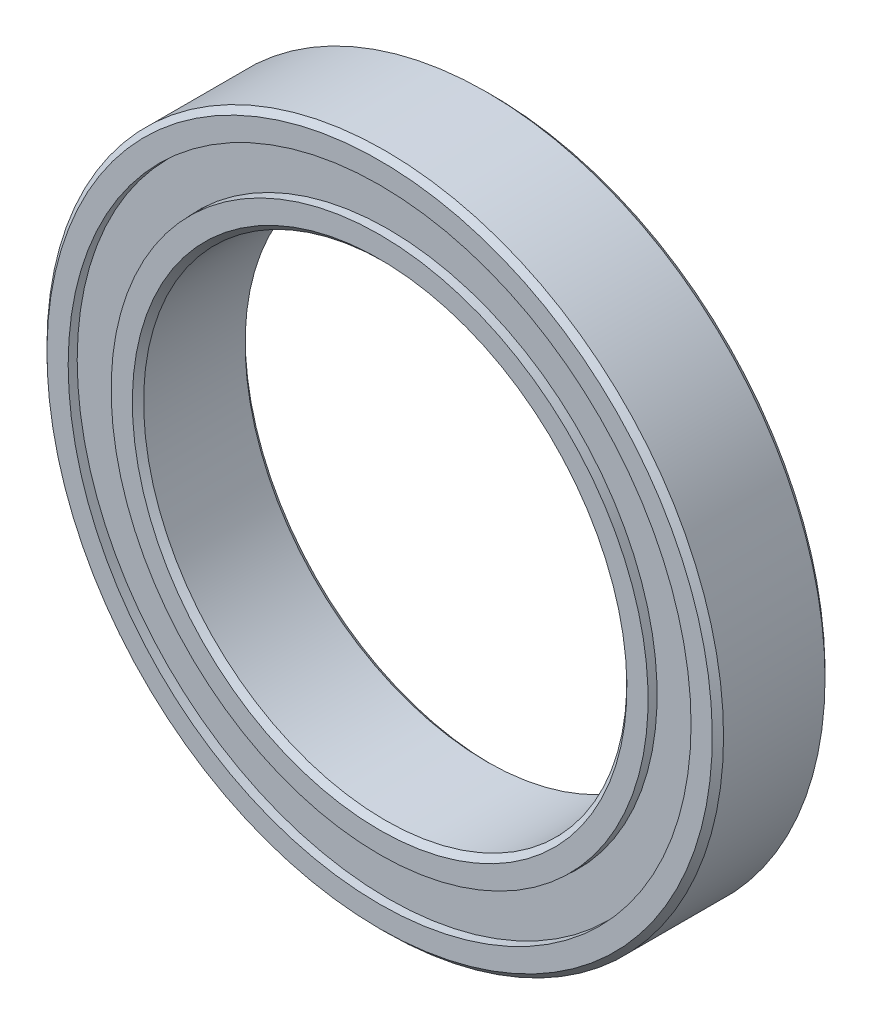
ISO-10303-21;
HEADER;
FILE_DESCRIPTION(('STEP AP214'),'2;1');
FILE_NAME('part.step','',(''),(''),'','','');
FILE_SCHEMA(('AUTOMOTIVE_DESIGN { 1 0 10303 214 1 1 1 1 }'));
ENDSEC;
DATA;
#1=APPLICATION_CONTEXT('core data for automotive mechanical design processes');
#2=APPLICATION_PROTOCOL_DEFINITION('international standard','automotive_design',2000,#1);
#3=PRODUCT_CONTEXT('',#1,'mechanical');
#4=PRODUCT('Part','Part','',(#3));
#5=PRODUCT_RELATED_PRODUCT_CATEGORY('part','',(#4));
#6=PRODUCT_DEFINITION_FORMATION('','',#4);
#7=PRODUCT_DEFINITION_CONTEXT('part definition',#1,'design');
#8=PRODUCT_DEFINITION('design','',#6,#7);
#9=PRODUCT_DEFINITION_SHAPE('','',#8);
#10=(LENGTH_UNIT() NAMED_UNIT(*) SI_UNIT(.MILLI.,.METRE.));
#11=(NAMED_UNIT(*) PLANE_ANGLE_UNIT() SI_UNIT($,.RADIAN.));
#12=(NAMED_UNIT(*) SI_UNIT($,.STERADIAN.) SOLID_ANGLE_UNIT());
#13=UNCERTAINTY_MEASURE_WITH_UNIT(LENGTH_MEASURE(1.E-05),#10,'distance_accuracy_value','');
#14=(GEOMETRIC_REPRESENTATION_CONTEXT(3) GLOBAL_UNCERTAINTY_ASSIGNED_CONTEXT((#13)) GLOBAL_UNIT_ASSIGNED_CONTEXT((#10,
#11,#12)) REPRESENTATION_CONTEXT('',''));
#15=CARTESIAN_POINT('',(0.,0.,0.));
#16=DIRECTION('',(0.,0.,1.));
#17=DIRECTION('',(1.,0.,0.));
#18=AXIS2_PLACEMENT_3D('',#15,#16,#17);
#19=CARTESIAN_POINT('',(6.50234999136853,16.7845001292785,0.));
#20=DIRECTION('',(0.,0.,1.));
#21=DIRECTION('',(0.361241666187141,0.932472229404361,0.));
#22=AXIS2_PLACEMENT_3D('',#19,#20,#21);
#23=SPHERICAL_SURFACE('',#22,2.0487876571762);
#24=CARTESIAN_POINT('',(6.50234999136853,16.7845001292785,2.04878765717619));
#25=VERTEX_POINT('',#24);
#26=VERTEX_LOOP('',#25);
#27=FACE_BOUND('',#26,.T.);
#28=ADVANCED_FACE('F37',(#27),#23,.T.);
#29=CLOSED_SHELL('',(#28));
#30=MANIFOLD_SOLID_BREP('B2',#29);
#31=CARTESIAN_POINT('',(12.1265215856379,13.302160509972,0.));
#32=DIRECTION('',(0.,0.,1.));
#33=DIRECTION('',(0.673695643646548,0.739008917220668,0.));
#34=AXIS2_PLACEMENT_3D('',#31,#32,#33);
#35=SPHERICAL_SURFACE('',#34,2.0487876571762);
#36=CARTESIAN_POINT('',(12.1265215856379,13.302160509972,2.04878765717619));
#37=VERTEX_POINT('',#36);
#38=VERTEX_LOOP('',#37);
#39=FACE_BOUND('',#38,.T.);
#40=ADVANCED_FACE('F57',(#39),#35,.T.);
#41=CLOSED_SHELL('',(#40));
#42=MANIFOLD_SOLID_BREP('B6',#41);
#43=CARTESIAN_POINT('',(16.112939244391,8.02329040397788,0.));
#44=DIRECTION('',(0.,0.,1.));
#45=DIRECTION('',(0.895163291355057,0.445738355776549,0.));
#46=AXIS2_PLACEMENT_3D('',#43,#44,#45);
#47=SPHERICAL_SURFACE('',#46,2.0487876571762);
#48=CARTESIAN_POINT('',(16.112939244391,8.02329040397788,2.04878765717619));
#49=VERTEX_POINT('',#48);
#50=VERTEX_LOOP('',#49);
#51=FACE_BOUND('',#50,.T.);
#52=ADVANCED_FACE('F77',(#51),#47,.T.);
#53=CLOSED_SHELL('',(#52));
#54=MANIFOLD_SOLID_BREP('B33',#53);
#55=CARTESIAN_POINT('',(17.9232151733106,1.66083047033963,0.));
#56=DIRECTION('',(0.,0.,1.));
#57=DIRECTION('',(0.995734176295033,0.092268359463313,0.));
#58=AXIS2_PLACEMENT_3D('',#55,#56,#57);
#59=SPHERICAL_SURFACE('',#58,2.0487876571762);
#60=CARTESIAN_POINT('',(17.9232151733106,1.66083047033963,2.04878765717619));
#61=VERTEX_POINT('',#60);
#62=VERTEX_LOOP('',#61);
#63=FACE_BOUND('',#62,.T.);
#64=ADVANCED_FACE('F97',(#63),#59,.T.);
#65=CLOSED_SHELL('',(#64));
#66=MANIFOLD_SOLID_BREP('B53',#65);
#67=CARTESIAN_POINT('',(17.3128615771108,-4.92593382129731,0.));
#68=DIRECTION('',(0.,0.,1.));
#69=DIRECTION('',(0.961825643172822,-0.273662990072073,0.));
#70=AXIS2_PLACEMENT_3D('',#67,#68,#69);
#71=SPHERICAL_SURFACE('',#70,2.0487876571762);
#72=CARTESIAN_POINT('',(17.3128615771108,-4.92593382129731,2.04878765717619));
#73=VERTEX_POINT('',#72);
#74=VERTEX_LOOP('',#73);
#75=FACE_BOUND('',#74,.T.);
#76=ADVANCED_FACE('F117',(#75),#71,.T.);
#77=CLOSED_SHELL('',(#76));
#78=MANIFOLD_SOLID_BREP('B73',#77);
#79=CARTESIAN_POINT('',(14.3643100910444,-10.8474234548265,0.));
#80=DIRECTION('',(0.,0.,1.));
#81=DIRECTION('',(0.798017227280245,-0.602634636379249,0.));
#82=AXIS2_PLACEMENT_3D('',#79,#80,#81);
#83=SPHERICAL_SURFACE('',#82,2.0487876571762);
#84=CARTESIAN_POINT('',(14.3643100910444,-10.8474234548265,2.04878765717619));
#85=VERTEX_POINT('',#84);
#86=VERTEX_LOOP('',#85);
#87=FACE_BOUND('',#86,.T.);
#88=ADVANCED_FACE('F137',(#87),#83,.T.);
#89=CLOSED_SHELL('',(#88));
#90=MANIFOLD_SOLID_BREP('B93',#89);
#91=CARTESIAN_POINT('',(9.47577893179253,-15.303908443133,0.));
#92=DIRECTION('',(0.,0.,1.));
#93=DIRECTION('',(0.526432162877363,-0.85021713572961,0.));
#94=AXIS2_PLACEMENT_3D('',#91,#92,#93);
#95=SPHERICAL_SURFACE('',#94,2.0487876571762);
#96=CARTESIAN_POINT('',(9.47577893179253,-15.303908443133,2.04878765717619));
#97=VERTEX_POINT('',#96);
#98=VERTEX_LOOP('',#97);
#99=FACE_BOUND('',#98,.T.);
#100=ADVANCED_FACE('F157',(#99),#95,.T.);
#101=CLOSED_SHELL('',(#100));
#102=MANIFOLD_SOLID_BREP('B113',#101);
#103=CARTESIAN_POINT('',(3.3074913206984,-17.6935157943102,0.));
#104=DIRECTION('',(0.,0.,1.));
#105=DIRECTION('',(0.183749517816578,-0.9829730996839,0.));
#106=AXIS2_PLACEMENT_3D('',#103,#104,#105);
#107=SPHERICAL_SURFACE('',#106,2.0487876571762);
#108=CARTESIAN_POINT('',(3.3074913206984,-17.6935157943102,2.04878765717619));
#109=VERTEX_POINT('',#108);
#110=VERTEX_LOOP('',#109);
#111=FACE_BOUND('',#110,.T.);
#112=ADVANCED_FACE('F177',(#111),#107,.T.);
#113=CLOSED_SHELL('',(#112));
#114=MANIFOLD_SOLID_BREP('B133',#113);
#115=CARTESIAN_POINT('',(-3.30749132069815,-17.6935157943103,0.));
#116=DIRECTION('',(0.,0.,1.));
#117=DIRECTION('',(-0.183749517816564,-0.982973099683903,0.));
#118=AXIS2_PLACEMENT_3D('',#115,#116,#117);
#119=SPHERICAL_SURFACE('',#118,2.0487876571762);
#120=CARTESIAN_POINT('',(-3.30749132069815,-17.6935157943103,2.04878765717619));
#121=VERTEX_POINT('',#120);
#122=VERTEX_LOOP('',#121);
#123=FACE_BOUND('',#122,.T.);
#124=ADVANCED_FACE('F197',(#123),#119,.T.);
#125=CLOSED_SHELL('',(#124));
#126=MANIFOLD_SOLID_BREP('B153',#125);
#127=CARTESIAN_POINT('',(-9.47577893179231,-15.3039084431331,0.));
#128=DIRECTION('',(0.,0.,1.));
#129=DIRECTION('',(-0.526432162877351,-0.850217135729617,0.));
#130=AXIS2_PLACEMENT_3D('',#127,#128,#129);
#131=SPHERICAL_SURFACE('',#130,2.0487876571762);
#132=CARTESIAN_POINT('',(-9.47577893179231,-15.3039084431331,2.04878765717619));
#133=VERTEX_POINT('',#132);
#134=VERTEX_LOOP('',#133);
#135=FACE_BOUND('',#134,.T.);
#136=ADVANCED_FACE('F217',(#135),#131,.T.);
#137=CLOSED_SHELL('',(#136));
#138=MANIFOLD_SOLID_BREP('B173',#137);
#139=CARTESIAN_POINT('',(-14.3643100910443,-10.8474234548267,0.));
#140=DIRECTION('',(0.,0.,1.));
#141=DIRECTION('',(-0.798017227280236,-0.602634636379261,0.));
#142=AXIS2_PLACEMENT_3D('',#139,#140,#141);
#143=SPHERICAL_SURFACE('',#142,2.0487876571762);
#144=CARTESIAN_POINT('',(-14.3643100910443,-10.8474234548267,2.04878765717619));
#145=VERTEX_POINT('',#144);
#146=VERTEX_LOOP('',#145);
#147=FACE_BOUND('',#146,.T.);
#148=ADVANCED_FACE('F237',(#147),#143,.T.);
#149=CLOSED_SHELL('',(#148));
#150=MANIFOLD_SOLID_BREP('B193',#149);
#151=CARTESIAN_POINT('',(-17.3128615771107,-4.92593382129756,0.));
#152=DIRECTION('',(0.,0.,1.));
#153=DIRECTION('',(-0.961825643172818,-0.273662990072087,0.));
#154=AXIS2_PLACEMENT_3D('',#151,#152,#153);
#155=SPHERICAL_SURFACE('',#154,2.0487876571762);
#156=CARTESIAN_POINT('',(-17.3128615771107,-4.92593382129756,2.04878765717619));
#157=VERTEX_POINT('',#156);
#158=VERTEX_LOOP('',#157);
#159=FACE_BOUND('',#158,.T.);
#160=ADVANCED_FACE('F257',(#159),#155,.T.);
#161=CLOSED_SHELL('',(#160));
#162=MANIFOLD_SOLID_BREP('B213',#161);
#163=CARTESIAN_POINT('',(-17.9232151733106,1.66083047033938,0.));
#164=DIRECTION('',(0.,0.,1.));
#165=DIRECTION('',(-0.995734176295035,0.0922683594632987,0.));
#166=AXIS2_PLACEMENT_3D('',#163,#164,#165);
#167=SPHERICAL_SURFACE('',#166,2.0487876571762);
#168=CARTESIAN_POINT('',(-17.9232151733106,1.66083047033938,2.04878765717619));
#169=VERTEX_POINT('',#168);
#170=VERTEX_LOOP('',#169);
#171=FACE_BOUND('',#170,.T.);
#172=ADVANCED_FACE('F277',(#171),#167,.T.);
#173=CLOSED_SHELL('',(#172));
#174=MANIFOLD_SOLID_BREP('B233',#173);
#175=CARTESIAN_POINT('',(-16.1129392443911,8.02329040397765,0.));
#176=DIRECTION('',(0.,0.,1.));
#177=DIRECTION('',(-0.895163291355063,0.445738355776536,0.));
#178=AXIS2_PLACEMENT_3D('',#175,#176,#177);
#179=SPHERICAL_SURFACE('',#178,2.0487876571762);
#180=CARTESIAN_POINT('',(-16.1129392443911,8.02329040397765,2.04878765717619));
#181=VERTEX_POINT('',#180);
#182=VERTEX_LOOP('',#181);
#183=FACE_BOUND('',#182,.T.);
#184=ADVANCED_FACE('F297',(#183),#179,.T.);
#185=CLOSED_SHELL('',(#184));
#186=MANIFOLD_SOLID_BREP('B253',#185);
#187=CARTESIAN_POINT('',(-12.1265215856381,13.3021605099718,0.));
#188=DIRECTION('',(0.,0.,1.));
#189=DIRECTION('',(-0.673695643646558,0.739008917220658,0.));
#190=AXIS2_PLACEMENT_3D('',#187,#188,#189);
#191=SPHERICAL_SURFACE('',#190,2.0487876571762);
#192=CARTESIAN_POINT('',(-12.1265215856381,13.3021605099718,2.04878765717619));
#193=VERTEX_POINT('',#192);
#194=VERTEX_LOOP('',#193);
#195=FACE_BOUND('',#194,.T.);
#196=ADVANCED_FACE('F317',(#195),#191,.T.);
#197=CLOSED_SHELL('',(#196));
#198=MANIFOLD_SOLID_BREP('B273',#197);
#199=CARTESIAN_POINT('',(-6.50234999136877,16.7845001292784,0.));
#200=DIRECTION('',(0.,0.,1.));
#201=DIRECTION('',(-0.361241666187154,0.932472229404355,0.));
#202=AXIS2_PLACEMENT_3D('',#199,#200,#201);
#203=SPHERICAL_SURFACE('',#202,2.0487876571762);
#204=CARTESIAN_POINT('',(-6.50234999136877,16.7845001292784,2.04878765717619));
#205=VERTEX_POINT('',#204);
#206=VERTEX_LOOP('',#205);
#207=FACE_BOUND('',#206,.T.);
#208=ADVANCED_FACE('F337',(#207),#203,.T.);
#209=CLOSED_SHELL('',(#208));
#210=MANIFOLD_SOLID_BREP('B293',#209);
#211=CARTESIAN_POINT('',(0.,18.,0.));
#212=DIRECTION('',(0.,0.,1.));
#213=DIRECTION('',(0.,1.,0.));
#214=AXIS2_PLACEMENT_3D('',#211,#212,#213);
#215=SPHERICAL_SURFACE('',#214,2.0487876571762);
#216=CARTESIAN_POINT('',(0.,18.,2.04878765717619));
#217=VERTEX_POINT('',#216);
#218=VERTEX_LOOP('',#217);
#219=FACE_BOUND('',#218,.T.);
#220=ADVANCED_FACE('F359',(#219),#215,.T.);
#221=CLOSED_SHELL('',(#220));
#222=MANIFOLD_SOLID_BREP('B313',#221);
#223=CARTESIAN_POINT('',(0.,16.6666666666667,3.50000000000003));
#224=DIRECTION('',(0.,0.,-1.));
#225=DIRECTION('',(0.,1.,0.));
#226=AXIS2_PLACEMENT_3D('',#223,#224,#225);
#227=PLANE('',#226);
#228=CARTESIAN_POINT('',(0.,0.,3.50000000000002));
#229=DIRECTION('',(0.,0.,1.));
#230=DIRECTION('',(0.,-1.,0.));
#231=AXIS2_PLACEMENT_3D('',#228,#229,#230);
#232=CIRCLE('',#231,15.35);
#233=CARTESIAN_POINT('',(0.,-15.35,3.50000000000002));
#234=VERTEX_POINT('',#233);
#235=EDGE_CURVE('E407',#234,#234,#232,.T.);
#236=ORIENTED_EDGE('',*,*,#235,.F.);
#237=EDGE_LOOP('',(#236));
#238=FACE_BOUND('',#237,.T.);
#239=CARTESIAN_POINT('',(0.,0.,3.50000000000002));
#240=DIRECTION('',(0.,0.,1.));
#241=DIRECTION('',(0.,-1.,0.));
#242=AXIS2_PLACEMENT_3D('',#239,#240,#241);
#243=CIRCLE('',#242,16.6666666666667);
#244=CARTESIAN_POINT('',(0.,-16.6666666666667,3.50000000000002));
#245=VERTEX_POINT('',#244);
#246=EDGE_CURVE('E358',#245,#245,#243,.T.);
#247=ORIENTED_EDGE('',*,*,#246,.T.);
#248=EDGE_LOOP('',(#247));
#249=FACE_BOUND('',#248,.T.);
#250=ADVANCED_FACE('F379',(#238,#249),#227,.F.);
#251=CARTESIAN_POINT('',(0.,0.,3.50000000000002));
#252=DIRECTION('',(0.,0.,1.));
#253=DIRECTION('',(0.,-1.,0.));
#254=AXIS2_PLACEMENT_3D('',#251,#252,#253);
#255=CYLINDRICAL_SURFACE('',#254,16.6666666666667);
#256=ORIENTED_EDGE('',*,*,#246,.F.);
#257=EDGE_LOOP('',(#256));
#258=FACE_BOUND('',#257,.T.);
#259=CARTESIAN_POINT('',(0.,0.,1.55555555555555));
#260=DIRECTION('',(0.,0.,1.));
#261=DIRECTION('',(0.,-1.,0.));
#262=AXIS2_PLACEMENT_3D('',#259,#260,#261);
#263=CIRCLE('',#262,16.6666666666667);
#264=CARTESIAN_POINT('',(0.,-16.6666666666667,1.55555555555555));
#265=VERTEX_POINT('',#264);
#266=EDGE_CURVE('E385',#265,#265,#263,.T.);
#267=ORIENTED_EDGE('',*,*,#266,.T.);
#268=EDGE_LOOP('',(#267));
#269=FACE_BOUND('',#268,.T.);
#270=ADVANCED_FACE('F414',(#258,#269),#255,.T.);
#271=CARTESIAN_POINT('',(0.,0.,0.));
#272=DIRECTION('',(0.,0.,1.));
#273=DIRECTION('',(0.,-1.,0.));
#274=AXIS2_PLACEMENT_3D('',#271,#272,#273);
#275=TOROIDAL_SURFACE('',#274,18.,2.0487876571762);
#276=ORIENTED_EDGE('',*,*,#266,.F.);
#277=EDGE_LOOP('',(#276));
#278=FACE_BOUND('',#277,.T.);
#279=CARTESIAN_POINT('',(0.,0.,-1.55555555555555));
#280=DIRECTION('',(0.,0.,1.));
#281=DIRECTION('',(0.,-1.,0.));
#282=AXIS2_PLACEMENT_3D('',#279,#280,#281);
#283=CIRCLE('',#282,16.6666666666667);
#284=CARTESIAN_POINT('',(0.,-16.6666666666667,-1.55555555555556));
#285=VERTEX_POINT('',#284);
#286=EDGE_CURVE('E389',#285,#285,#283,.T.);
#287=ORIENTED_EDGE('',*,*,#286,.T.);
#288=EDGE_LOOP('',(#287));
#289=FACE_BOUND('',#288,.T.);
#290=ADVANCED_FACE('F418',(#278,#289),#275,.F.);
#291=CARTESIAN_POINT('',(0.,0.,3.50000000000002));
#292=DIRECTION('',(0.,0.,1.));
#293=DIRECTION('',(0.,-1.,0.));
#294=AXIS2_PLACEMENT_3D('',#291,#292,#293);
#295=CYLINDRICAL_SURFACE('',#294,16.6666666666667);
#296=ORIENTED_EDGE('',*,*,#286,.F.);
#297=EDGE_LOOP('',(#296));
#298=FACE_BOUND('',#297,.T.);
#299=CARTESIAN_POINT('',(0.,0.,-3.50000000000003));
#300=DIRECTION('',(0.,0.,1.));
#301=DIRECTION('',(0.,-1.,0.));
#302=AXIS2_PLACEMENT_3D('',#299,#300,#301);
#303=CIRCLE('',#302,16.6666666666667);
#304=CARTESIAN_POINT('',(0.,-16.6666666666667,-3.50000000000003));
#305=VERTEX_POINT('',#304);
#306=EDGE_CURVE('E393',#305,#305,#303,.T.);
#307=ORIENTED_EDGE('',*,*,#306,.T.);
#308=EDGE_LOOP('',(#307));
#309=FACE_BOUND('',#308,.T.);
#310=ADVANCED_FACE('F423',(#298,#309),#295,.T.);
#311=CARTESIAN_POINT('',(0.,15.35,-3.50000000000003));
#312=DIRECTION('',(0.,0.,1.));
#313=DIRECTION('',(0.,-1.,0.));
#314=AXIS2_PLACEMENT_3D('',#311,#312,#313);
#315=PLANE('',#314);
#316=ORIENTED_EDGE('',*,*,#306,.F.);
#317=EDGE_LOOP('',(#316));
#318=FACE_BOUND('',#317,.T.);
#319=CARTESIAN_POINT('',(0.,0.,-3.50000000000003));
#320=DIRECTION('',(0.,0.,1.));
#321=DIRECTION('',(0.,-1.,0.));
#322=AXIS2_PLACEMENT_3D('',#319,#320,#321);
#323=CIRCLE('',#322,15.35);
#324=CARTESIAN_POINT('',(0.,-15.35,-3.50000000000003));
#325=VERTEX_POINT('',#324);
#326=EDGE_CURVE('E398',#325,#325,#323,.T.);
#327=ORIENTED_EDGE('',*,*,#326,.T.);
#328=EDGE_LOOP('',(#327));
#329=FACE_BOUND('',#328,.T.);
#330=ADVANCED_FACE('F429',(#318,#329),#315,.F.);
#331=CARTESIAN_POINT('',(0.,0.,-3.15000000000003));
#332=DIRECTION('',(0.,0.,-1.));
#333=DIRECTION('',(0.,1.,0.));
#334=AXIS2_PLACEMENT_3D('',#331,#332,#333);
#335=CONICAL_SURFACE('',#334,15.,0.785398163397435);
#336=ORIENTED_EDGE('',*,*,#326,.F.);
#337=EDGE_LOOP('',(#336));
#338=FACE_BOUND('',#337,.T.);
#339=CARTESIAN_POINT('',(0.,0.,-3.15000000000003));
#340=DIRECTION('',(0.,0.,1.));
#341=DIRECTION('',(0.,-1.,0.));
#342=AXIS2_PLACEMENT_3D('',#339,#340,#341);
#343=CIRCLE('',#342,15.);
#344=CARTESIAN_POINT('',(0.,-15.,-3.15000000000003));
#345=VERTEX_POINT('',#344);
#346=EDGE_CURVE('E401',#345,#345,#343,.T.);
#347=ORIENTED_EDGE('',*,*,#346,.T.);
#348=EDGE_LOOP('',(#347));
#349=FACE_BOUND('',#348,.T.);
#350=ADVANCED_FACE('F433',(#338,#349),#335,.F.);
#351=CARTESIAN_POINT('',(0.,0.,3.50000000000002));
#352=DIRECTION('',(0.,0.,1.));
#353=DIRECTION('',(0.,-1.,0.));
#354=AXIS2_PLACEMENT_3D('',#351,#352,#353);
#355=CYLINDRICAL_SURFACE('',#354,15.);
#356=ORIENTED_EDGE('',*,*,#346,.F.);
#357=EDGE_LOOP('',(#356));
#358=FACE_BOUND('',#357,.T.);
#359=CARTESIAN_POINT('',(0.,0.,3.15000000000003));
#360=DIRECTION('',(0.,0.,1.));
#361=DIRECTION('',(0.,-1.,0.));
#362=AXIS2_PLACEMENT_3D('',#359,#360,#361);
#363=CIRCLE('',#362,15.);
#364=CARTESIAN_POINT('',(0.,-15.,3.15000000000003));
#365=VERTEX_POINT('',#364);
#366=EDGE_CURVE('E404',#365,#365,#363,.T.);
#367=ORIENTED_EDGE('',*,*,#366,.T.);
#368=EDGE_LOOP('',(#367));
#369=FACE_BOUND('',#368,.T.);
#370=ADVANCED_FACE('F437',(#358,#369),#355,.F.);
#371=CARTESIAN_POINT('',(0.,0.,3.50000000000002));
#372=DIRECTION('',(0.,0.,1.));
#373=DIRECTION('',(0.,-1.,0.));
#374=AXIS2_PLACEMENT_3D('',#371,#372,#373);
#375=CONICAL_SURFACE('',#374,15.35,0.785398163397458);
#376=ORIENTED_EDGE('',*,*,#366,.F.);
#377=EDGE_LOOP('',(#376));
#378=FACE_BOUND('',#377,.T.);
#379=ORIENTED_EDGE('',*,*,#235,.T.);
#380=EDGE_LOOP('',(#379));
#381=FACE_BOUND('',#380,.T.);
#382=ADVANCED_FACE('F411',(#378,#381),#375,.F.);
#383=CLOSED_SHELL('',(#250,#270,#290,#310,#330,#350,#370,#382));
#384=MANIFOLD_SOLID_BREP('B333',#383);
#385=CARTESIAN_POINT('',(0.,16.6920666666667,-2.58389382858811));
#386=DIRECTION('',(0.,0.,-1.));
#387=DIRECTION('',(0.,1.,0.));
#388=AXIS2_PLACEMENT_3D('',#385,#386,#387);
#389=PLANE('',#388);
#390=CARTESIAN_POINT('',(0.,0.,-2.58389382858812));
#391=DIRECTION('',(0.,0.,1.));
#392=DIRECTION('',(0.,-1.,0.));
#393=AXIS2_PLACEMENT_3D('',#390,#391,#392);
#394=CIRCLE('',#393,16.6920666666667);
#395=CARTESIAN_POINT('',(0.,-16.6920666666667,-2.58389382858812));
#396=VERTEX_POINT('',#395);
#397=EDGE_CURVE('E522',#396,#396,#394,.T.);
#398=ORIENTED_EDGE('',*,*,#397,.F.);
#399=EDGE_LOOP('',(#398));
#400=FACE_BOUND('',#399,.T.);
#401=CARTESIAN_POINT('',(0.,0.,-2.58389382858812));
#402=DIRECTION('',(0.,0.,1.));
#403=DIRECTION('',(0.,-1.,0.));
#404=AXIS2_PLACEMENT_3D('',#401,#402,#403);
#405=CIRCLE('',#404,19.3079333333333);
#406=CARTESIAN_POINT('',(0.,-19.3079333333333,-2.58389382858812));
#407=VERTEX_POINT('',#406);
#408=EDGE_CURVE('E378',#407,#407,#405,.T.);
#409=ORIENTED_EDGE('',*,*,#408,.T.);
#410=EDGE_LOOP('',(#409));
#411=FACE_BOUND('',#410,.T.);
#412=ADVANCED_FACE('F508',(#400,#411),#389,.F.);
#413=CARTESIAN_POINT('',(0.,0.,3.50000000000002));
#414=DIRECTION('',(0.,0.,1.));
#415=DIRECTION('',(0.,-1.,0.));
#416=AXIS2_PLACEMENT_3D('',#413,#414,#415);
#417=CYLINDRICAL_SURFACE('',#416,19.3079333333333);
#418=ORIENTED_EDGE('',*,*,#408,.F.);
#419=EDGE_LOOP('',(#418));
#420=FACE_BOUND('',#419,.T.);
#421=CARTESIAN_POINT('',(0.,0.,-2.96489382858812));
#422=DIRECTION('',(0.,0.,1.));
#423=DIRECTION('',(0.,-1.,0.));
#424=AXIS2_PLACEMENT_3D('',#421,#422,#423);
#425=CIRCLE('',#424,19.3079333333333);
#426=CARTESIAN_POINT('',(0.,-19.3079333333333,-2.96489382858812));
#427=VERTEX_POINT('',#426);
#428=EDGE_CURVE('E514',#427,#427,#425,.T.);
#429=ORIENTED_EDGE('',*,*,#428,.T.);
#430=EDGE_LOOP('',(#429));
#431=FACE_BOUND('',#430,.T.);
#432=ADVANCED_FACE('F531',(#420,#431),#417,.T.);
#433=CARTESIAN_POINT('',(0.,16.6920666666667,-2.96489382858811));
#434=DIRECTION('',(0.,0.,1.));
#435=DIRECTION('',(0.,-1.,0.));
#436=AXIS2_PLACEMENT_3D('',#433,#434,#435);
#437=PLANE('',#436);
#438=ORIENTED_EDGE('',*,*,#428,.F.);
#439=EDGE_LOOP('',(#438));
#440=FACE_BOUND('',#439,.T.);
#441=CARTESIAN_POINT('',(0.,0.,-2.96489382858812));
#442=DIRECTION('',(0.,0.,1.));
#443=DIRECTION('',(0.,-1.,0.));
#444=AXIS2_PLACEMENT_3D('',#441,#442,#443);
#445=CIRCLE('',#444,16.6920666666667);
#446=CARTESIAN_POINT('',(0.,-16.6920666666667,-2.96489382858812));
#447=VERTEX_POINT('',#446);
#448=EDGE_CURVE('E518',#447,#447,#445,.T.);
#449=ORIENTED_EDGE('',*,*,#448,.T.);
#450=EDGE_LOOP('',(#449));
#451=FACE_BOUND('',#450,.T.);
#452=ADVANCED_FACE('F535',(#440,#451),#437,.F.);
#453=CARTESIAN_POINT('',(0.,0.,3.50000000000002));
#454=DIRECTION('',(0.,0.,1.));
#455=DIRECTION('',(0.,-1.,0.));
#456=AXIS2_PLACEMENT_3D('',#453,#454,#455);
#457=CYLINDRICAL_SURFACE('',#456,16.6920666666667);
#458=ORIENTED_EDGE('',*,*,#448,.F.);
#459=EDGE_LOOP('',(#458));
#460=FACE_BOUND('',#459,.T.);
#461=ORIENTED_EDGE('',*,*,#397,.T.);
#462=EDGE_LOOP('',(#461));
#463=FACE_BOUND('',#462,.T.);
#464=ADVANCED_FACE('F528',(#460,#463),#457,.F.);
#465=CLOSED_SHELL('',(#412,#432,#452,#464));
#466=MANIFOLD_SOLID_BREP('B353',#465);
#467=CARTESIAN_POINT('',(0.,16.6920666666667,2.9648938285881));
#468=DIRECTION('',(0.,0.,-1.));
#469=DIRECTION('',(0.,1.,0.));
#470=AXIS2_PLACEMENT_3D('',#467,#468,#469);
#471=PLANE('',#470);
#472=CARTESIAN_POINT('',(0.,0.,2.9648938285881));
#473=DIRECTION('',(0.,0.,1.));
#474=DIRECTION('',(0.,-1.,0.));
#475=AXIS2_PLACEMENT_3D('',#472,#473,#474);
#476=CIRCLE('',#475,16.6920666666667);
#477=CARTESIAN_POINT('',(0.,-16.6920666666667,2.9648938285881));
#478=VERTEX_POINT('',#477);
#479=EDGE_CURVE('E507',#478,#478,#476,.T.);
#480=ORIENTED_EDGE('',*,*,#479,.F.);
#481=EDGE_LOOP('',(#480));
#482=FACE_BOUND('',#481,.T.);
#483=CARTESIAN_POINT('',(0.,0.,2.9648938285881));
#484=DIRECTION('',(0.,0.,1.));
#485=DIRECTION('',(0.,-1.,0.));
#486=AXIS2_PLACEMENT_3D('',#483,#484,#485);
#487=CIRCLE('',#486,19.3079333333333);
#488=CARTESIAN_POINT('',(0.,-19.3079333333333,2.9648938285881));
#489=VERTEX_POINT('',#488);
#490=EDGE_CURVE('E590',#489,#489,#487,.T.);
#491=ORIENTED_EDGE('',*,*,#490,.T.);
#492=EDGE_LOOP('',(#491));
#493=FACE_BOUND('',#492,.T.);
#494=ADVANCED_FACE('F576',(#482,#493),#471,.F.);
#495=CARTESIAN_POINT('',(0.,0.,3.50000000000002));
#496=DIRECTION('',(0.,0.,1.));
#497=DIRECTION('',(0.,-1.,0.));
#498=AXIS2_PLACEMENT_3D('',#495,#496,#497);
#499=CYLINDRICAL_SURFACE('',#498,16.6920666666667);
#500=CARTESIAN_POINT('',(0.,0.,2.5838938285881));
#501=DIRECTION('',(0.,0.,1.));
#502=DIRECTION('',(0.,-1.,0.));
#503=AXIS2_PLACEMENT_3D('',#500,#501,#502);
#504=CIRCLE('',#503,16.6920666666667);
#505=CARTESIAN_POINT('',(0.,-16.6920666666667,2.5838938285881));
#506=VERTEX_POINT('',#505);
#507=EDGE_CURVE('E582',#506,#506,#504,.T.);
#508=ORIENTED_EDGE('',*,*,#507,.F.);
#509=EDGE_LOOP('',(#508));
#510=FACE_BOUND('',#509,.T.);
#511=ORIENTED_EDGE('',*,*,#479,.T.);
#512=EDGE_LOOP('',(#511));
#513=FACE_BOUND('',#512,.T.);
#514=ADVANCED_FACE('F605',(#510,#513),#499,.F.);
#515=CARTESIAN_POINT('',(0.,16.6920666666667,2.5838938285881));
#516=DIRECTION('',(0.,0.,1.));
#517=DIRECTION('',(0.,-1.,0.));
#518=AXIS2_PLACEMENT_3D('',#515,#516,#517);
#519=PLANE('',#518);
#520=CARTESIAN_POINT('',(0.,0.,2.5838938285881));
#521=DIRECTION('',(0.,0.,1.));
#522=DIRECTION('',(0.,-1.,0.));
#523=AXIS2_PLACEMENT_3D('',#520,#521,#522);
#524=CIRCLE('',#523,19.3079333333333);
#525=CARTESIAN_POINT('',(0.,-19.3079333333333,2.5838938285881));
#526=VERTEX_POINT('',#525);
#527=EDGE_CURVE('E586',#526,#526,#524,.T.);
#528=ORIENTED_EDGE('',*,*,#527,.F.);
#529=EDGE_LOOP('',(#528));
#530=FACE_BOUND('',#529,.T.);
#531=ORIENTED_EDGE('',*,*,#507,.T.);
#532=EDGE_LOOP('',(#531));
#533=FACE_BOUND('',#532,.T.);
#534=ADVANCED_FACE('F600',(#530,#533),#519,.F.);
#535=CARTESIAN_POINT('',(0.,0.,3.50000000000002));
#536=DIRECTION('',(0.,0.,1.));
#537=DIRECTION('',(0.,-1.,0.));
#538=AXIS2_PLACEMENT_3D('',#535,#536,#537);
#539=CYLINDRICAL_SURFACE('',#538,19.3079333333333);
#540=ORIENTED_EDGE('',*,*,#490,.F.);
#541=EDGE_LOOP('',(#540));
#542=FACE_BOUND('',#541,.T.);
#543=ORIENTED_EDGE('',*,*,#527,.T.);
#544=EDGE_LOOP('',(#543));
#545=FACE_BOUND('',#544,.T.);
#546=ADVANCED_FACE('F597',(#542,#545),#539,.T.);
#547=CLOSED_SHELL('',(#494,#514,#534,#546));
#548=MANIFOLD_SOLID_BREP('B373',#547);
#549=CARTESIAN_POINT('',(0.,0.,3.15000000000001));
#550=DIRECTION('',(0.,0.,-1.));
#551=DIRECTION('',(0.,1.,0.));
#552=AXIS2_PLACEMENT_3D('',#549,#550,#551);
#553=CONICAL_SURFACE('',#552,21.,0.785398163397447);
#554=CARTESIAN_POINT('',(0.,0.,3.50000000000001));
#555=DIRECTION('',(0.,0.,1.));
#556=DIRECTION('',(0.,-1.,0.));
#557=AXIS2_PLACEMENT_3D('',#554,#555,#556);
#558=CIRCLE('',#557,20.65);
#559=CARTESIAN_POINT('',(0.,-20.65,3.50000000000001));
#560=VERTEX_POINT('',#559);
#561=EDGE_CURVE('E665',#560,#560,#558,.T.);
#562=ORIENTED_EDGE('',*,*,#561,.F.);
#563=EDGE_LOOP('',(#562));
#564=FACE_BOUND('',#563,.T.);
#565=CARTESIAN_POINT('',(0.,0.,3.15000000000001));
#566=DIRECTION('',(0.,0.,1.));
#567=DIRECTION('',(0.,-1.,0.));
#568=AXIS2_PLACEMENT_3D('',#565,#566,#567);
#569=CIRCLE('',#568,21.);
#570=CARTESIAN_POINT('',(0.,-21.,3.15000000000001));
#571=VERTEX_POINT('',#570);
#572=EDGE_CURVE('E575',#571,#571,#569,.T.);
#573=ORIENTED_EDGE('',*,*,#572,.T.);
#574=EDGE_LOOP('',(#573));
#575=FACE_BOUND('',#574,.T.);
#576=ADVANCED_FACE('F637',(#564,#575),#553,.T.);
#577=CARTESIAN_POINT('',(0.,0.,3.50000000000002));
#578=DIRECTION('',(0.,0.,1.));
#579=DIRECTION('',(0.,-1.,0.));
#580=AXIS2_PLACEMENT_3D('',#577,#578,#579);
#581=CYLINDRICAL_SURFACE('',#580,21.);
#582=ORIENTED_EDGE('',*,*,#572,.F.);
#583=EDGE_LOOP('',(#582));
#584=FACE_BOUND('',#583,.T.);
#585=CARTESIAN_POINT('',(0.,0.,-3.15000000000003));
#586=DIRECTION('',(0.,0.,1.));
#587=DIRECTION('',(0.,-1.,0.));
#588=AXIS2_PLACEMENT_3D('',#585,#586,#587);
#589=CIRCLE('',#588,21.);
#590=CARTESIAN_POINT('',(0.,-21.,-3.15000000000003));
#591=VERTEX_POINT('',#590);
#592=EDGE_CURVE('E643',#591,#591,#589,.T.);
#593=ORIENTED_EDGE('',*,*,#592,.T.);
#594=EDGE_LOOP('',(#593));
#595=FACE_BOUND('',#594,.T.);
#596=ADVANCED_FACE('F672',(#584,#595),#581,.T.);
#597=CARTESIAN_POINT('',(0.,0.,-3.50000000000003));
#598=DIRECTION('',(0.,0.,1.));
#599=DIRECTION('',(0.,-1.,0.));
#600=AXIS2_PLACEMENT_3D('',#597,#598,#599);
#601=CONICAL_SURFACE('',#600,20.65,0.785398163397447);
#602=ORIENTED_EDGE('',*,*,#592,.F.);
#603=EDGE_LOOP('',(#602));
#604=FACE_BOUND('',#603,.T.);
#605=CARTESIAN_POINT('',(0.,0.,-3.50000000000003));
#606=DIRECTION('',(0.,0.,1.));
#607=DIRECTION('',(0.,-1.,0.));
#608=AXIS2_PLACEMENT_3D('',#605,#606,#607);
#609=CIRCLE('',#608,20.65);
#610=CARTESIAN_POINT('',(0.,-20.65,-3.50000000000003));
#611=VERTEX_POINT('',#610);
#612=EDGE_CURVE('E647',#611,#611,#609,.T.);
#613=ORIENTED_EDGE('',*,*,#612,.T.);
#614=EDGE_LOOP('',(#613));
#615=FACE_BOUND('',#614,.T.);
#616=ADVANCED_FACE('F676',(#604,#615),#601,.T.);
#617=CARTESIAN_POINT('',(0.,20.65,-3.50000000000002));
#618=DIRECTION('',(0.,0.,1.));
#619=DIRECTION('',(0.,-1.,0.));
#620=AXIS2_PLACEMENT_3D('',#617,#618,#619);
#621=PLANE('',#620);
#622=ORIENTED_EDGE('',*,*,#612,.F.);
#623=EDGE_LOOP('',(#622));
#624=FACE_BOUND('',#623,.T.);
#625=CARTESIAN_POINT('',(0.,0.,-3.50000000000002));
#626=DIRECTION('',(0.,0.,1.));
#627=DIRECTION('',(0.,-1.,0.));
#628=AXIS2_PLACEMENT_3D('',#625,#626,#627);
#629=CIRCLE('',#628,19.3333333333333);
#630=CARTESIAN_POINT('',(0.,-19.3333333333333,-3.50000000000003));
#631=VERTEX_POINT('',#630);
#632=EDGE_CURVE('E651',#631,#631,#629,.T.);
#633=ORIENTED_EDGE('',*,*,#632,.T.);
#634=EDGE_LOOP('',(#633));
#635=FACE_BOUND('',#634,.T.);
#636=ADVANCED_FACE('F681',(#624,#635),#621,.F.);
#637=CARTESIAN_POINT('',(0.,0.,3.50000000000002));
#638=DIRECTION('',(0.,0.,1.));
#639=DIRECTION('',(0.,-1.,0.));
#640=AXIS2_PLACEMENT_3D('',#637,#638,#639);
#641=CYLINDRICAL_SURFACE('',#640,19.3333333333333);
#642=ORIENTED_EDGE('',*,*,#632,.F.);
#643=EDGE_LOOP('',(#642));
#644=FACE_BOUND('',#643,.T.);
#645=CARTESIAN_POINT('',(0.,0.,-1.55555555555556));
#646=DIRECTION('',(0.,0.,1.));
#647=DIRECTION('',(0.,-1.,0.));
#648=AXIS2_PLACEMENT_3D('',#645,#646,#647);
#649=CIRCLE('',#648,19.3333333333333);
#650=CARTESIAN_POINT('',(0.,-19.3333333333333,-1.55555555555556));
#651=VERTEX_POINT('',#650);
#652=EDGE_CURVE('E656',#651,#651,#649,.T.);
#653=ORIENTED_EDGE('',*,*,#652,.T.);
#654=EDGE_LOOP('',(#653));
#655=FACE_BOUND('',#654,.T.);
#656=ADVANCED_FACE('F687',(#644,#655),#641,.F.);
#657=CARTESIAN_POINT('',(0.,0.,0.));
#658=DIRECTION('',(0.,0.,1.));
#659=DIRECTION('',(0.,-1.,0.));
#660=AXIS2_PLACEMENT_3D('',#657,#658,#659);
#661=TOROIDAL_SURFACE('',#660,18.,2.0487876571762);
#662=ORIENTED_EDGE('',*,*,#652,.F.);
#663=EDGE_LOOP('',(#662));
#664=FACE_BOUND('',#663,.T.);
#665=CARTESIAN_POINT('',(0.,0.,1.55555555555555));
#666=DIRECTION('',(0.,0.,1.));
#667=DIRECTION('',(0.,-1.,0.));
#668=AXIS2_PLACEMENT_3D('',#665,#666,#667);
#669=CIRCLE('',#668,19.3333333333333);
#670=CARTESIAN_POINT('',(0.,-19.3333333333333,1.55555555555555));
#671=VERTEX_POINT('',#670);
#672=EDGE_CURVE('E659',#671,#671,#669,.T.);
#673=ORIENTED_EDGE('',*,*,#672,.T.);
#674=EDGE_LOOP('',(#673));
#675=FACE_BOUND('',#674,.T.);
#676=ADVANCED_FACE('F691',(#664,#675),#661,.F.);
#677=CARTESIAN_POINT('',(0.,0.,3.50000000000002));
#678=DIRECTION('',(0.,0.,1.));
#679=DIRECTION('',(0.,-1.,0.));
#680=AXIS2_PLACEMENT_3D('',#677,#678,#679);
#681=CYLINDRICAL_SURFACE('',#680,19.3333333333333);
#682=ORIENTED_EDGE('',*,*,#672,.F.);
#683=EDGE_LOOP('',(#682));
#684=FACE_BOUND('',#683,.T.);
#685=CARTESIAN_POINT('',(0.,0.,3.50000000000001));
#686=DIRECTION('',(0.,0.,1.));
#687=DIRECTION('',(0.,-1.,0.));
#688=AXIS2_PLACEMENT_3D('',#685,#686,#687);
#689=CIRCLE('',#688,19.3333333333333);
#690=CARTESIAN_POINT('',(0.,-19.3333333333333,3.50000000000001));
#691=VERTEX_POINT('',#690);
#692=EDGE_CURVE('E662',#691,#691,#689,.T.);
#693=ORIENTED_EDGE('',*,*,#692,.T.);
#694=EDGE_LOOP('',(#693));
#695=FACE_BOUND('',#694,.T.);
#696=ADVANCED_FACE('F695',(#684,#695),#681,.F.);
#697=CARTESIAN_POINT('',(0.,20.65,3.50000000000002));
#698=DIRECTION('',(0.,0.,-1.));
#699=DIRECTION('',(0.,1.,0.));
#700=AXIS2_PLACEMENT_3D('',#697,#698,#699);
#701=PLANE('',#700);
#702=ORIENTED_EDGE('',*,*,#692,.F.);
#703=EDGE_LOOP('',(#702));
#704=FACE_BOUND('',#703,.T.);
#705=ORIENTED_EDGE('',*,*,#561,.T.);
#706=EDGE_LOOP('',(#705));
#707=FACE_BOUND('',#706,.T.);
#708=ADVANCED_FACE('F669',(#704,#707),#701,.F.);
#709=CLOSED_SHELL('',(#576,#596,#616,#636,#656,#676,#696,#708));
#710=MANIFOLD_SOLID_BREP('B502',#709);
#711=ADVANCED_BREP_SHAPE_REPRESENTATION('',(#18,#30,#42,#54,#66,#78,#90,#102,#114,#126,#138,
#150,#162,#174,#186,#198,#210,#222,#384,#466,#548,#710),#14);
#712=SHAPE_DEFINITION_REPRESENTATION(#9,#711);
ENDSEC;
END-ISO-10303-21;
